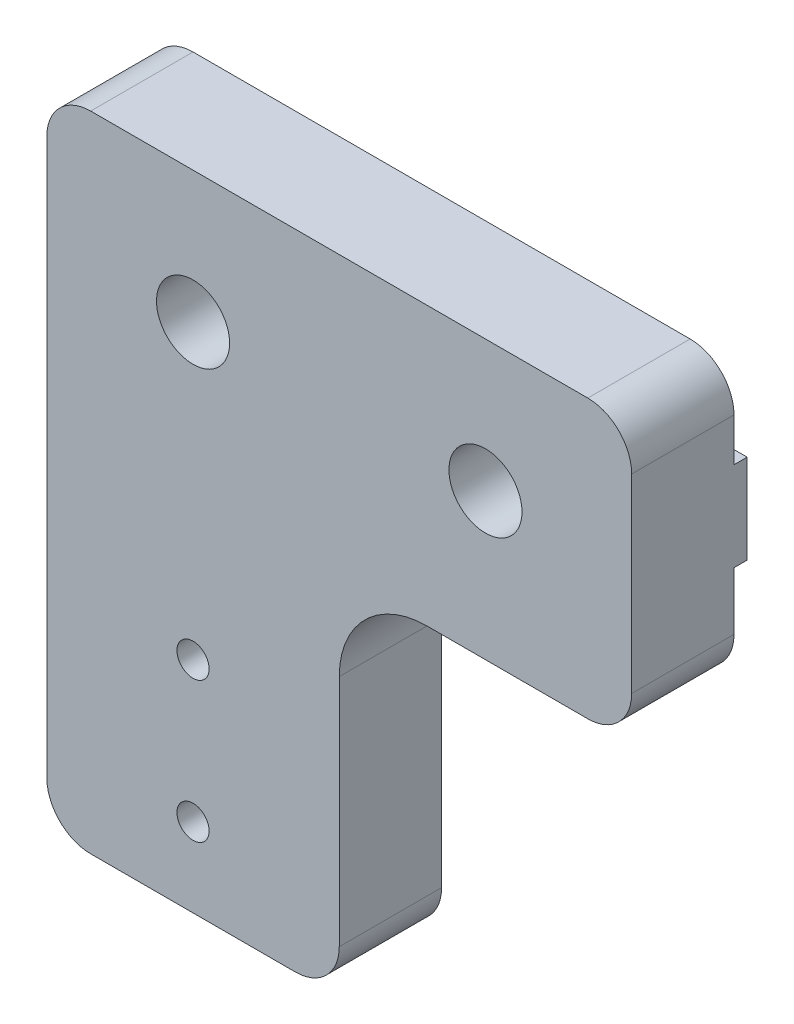
ISO-10303-21;
HEADER;
FILE_DESCRIPTION(('STEP AP214'),'2;1');
FILE_NAME('part.step','',(''),(''),'','','');
FILE_SCHEMA(('AUTOMOTIVE_DESIGN { 1 0 10303 214 1 1 1 1 }'));
ENDSEC;
DATA;
#1=APPLICATION_CONTEXT('core data for automotive mechanical design processes');
#2=APPLICATION_PROTOCOL_DEFINITION('international standard','automotive_design',2000,#1);
#3=PRODUCT_CONTEXT('',#1,'mechanical');
#4=PRODUCT('Part','Part','',(#3));
#5=PRODUCT_RELATED_PRODUCT_CATEGORY('part','',(#4));
#6=PRODUCT_DEFINITION_FORMATION('','',#4);
#7=PRODUCT_DEFINITION_CONTEXT('part definition',#1,'design');
#8=PRODUCT_DEFINITION('design','',#6,#7);
#9=PRODUCT_DEFINITION_SHAPE('','',#8);
#10=(LENGTH_UNIT() NAMED_UNIT(*) SI_UNIT(.MILLI.,.METRE.));
#11=(NAMED_UNIT(*) PLANE_ANGLE_UNIT() SI_UNIT($,.RADIAN.));
#12=(NAMED_UNIT(*) SI_UNIT($,.STERADIAN.) SOLID_ANGLE_UNIT());
#13=UNCERTAINTY_MEASURE_WITH_UNIT(LENGTH_MEASURE(1.E-05),#10,'distance_accuracy_value','');
#14=(GEOMETRIC_REPRESENTATION_CONTEXT(3) GLOBAL_UNCERTAINTY_ASSIGNED_CONTEXT((#13)) GLOBAL_UNIT_ASSIGNED_CONTEXT((#10,
#11,#12)) REPRESENTATION_CONTEXT('',''));
#15=CARTESIAN_POINT('',(0.,0.,0.));
#16=DIRECTION('',(0.,0.,1.));
#17=DIRECTION('',(1.,0.,0.));
#18=AXIS2_PLACEMENT_3D('',#15,#16,#17);
#19=CARTESIAN_POINT('',(26.,19.,0.));
#20=DIRECTION('',(0.,0.,-1.));
#21=DIRECTION('',(-1.,0.,0.));
#22=AXIS2_PLACEMENT_3D('',#19,#20,#21);
#23=PLANE('',#22);
#24=CARTESIAN_POINT('',(10.,5.4,0.));
#25=DIRECTION('',(0.,0.,1.));
#26=DIRECTION('',(1.,0.,0.));
#27=AXIS2_PLACEMENT_3D('',#24,#25,#26);
#28=CIRCLE('',#27,1.1);
#29=CARTESIAN_POINT('',(11.1,5.4,0.));
#30=VERTEX_POINT('',#29);
#31=EDGE_CURVE('E185',#30,#30,#28,.T.);
#32=ORIENTED_EDGE('',*,*,#31,.T.);
#33=EDGE_LOOP('',(#32));
#34=FACE_BOUND('',#33,.T.);
#35=CARTESIAN_POINT('',(10.,15.,0.));
#36=DIRECTION('',(0.,0.,1.));
#37=DIRECTION('',(1.,0.,0.));
#38=AXIS2_PLACEMENT_3D('',#35,#36,#37);
#39=CIRCLE('',#38,1.1);
#40=CARTESIAN_POINT('',(11.1,15.,0.));
#41=VERTEX_POINT('',#40);
#42=EDGE_CURVE('E186',#41,#41,#39,.T.);
#43=ORIENTED_EDGE('',*,*,#42,.T.);
#44=EDGE_LOOP('',(#43));
#45=FACE_BOUND('',#44,.T.);
#46=DIRECTION('',(0.,-1.,0.));
#47=VECTOR('',#46,1.);
#48=CARTESIAN_POINT('',(0.,41.,0.));
#49=LINE('',#48,#47);
#50=CARTESIAN_POINT('',(0.,31.95,0.));
#51=VERTEX_POINT('',#50);
#52=CARTESIAN_POINT('',(0.,3.00000000000002,0.));
#53=VERTEX_POINT('',#52);
#54=EDGE_CURVE('E54',#51,#53,#49,.T.);
#55=ORIENTED_EDGE('',*,*,#54,.F.);
#56=DIRECTION('',(1.,0.,0.));
#57=VECTOR('',#56,1.);
#58=CARTESIAN_POINT('',(-6.16603600378719,31.95,0.));
#59=LINE('',#58,#57);
#60=CARTESIAN_POINT('',(40.,31.95,0.));
#61=VERTEX_POINT('',#60);
#62=EDGE_CURVE('E49',#51,#61,#59,.T.);
#63=ORIENTED_EDGE('',*,*,#62,.T.);
#64=DIRECTION('',(0.,1.,0.));
#65=VECTOR('',#64,1.);
#66=CARTESIAN_POINT('',(40.,28.,0.));
#67=LINE('',#66,#65);
#68=CARTESIAN_POINT('',(40.,28.,0.));
#69=VERTEX_POINT('',#68);
#70=EDGE_CURVE('E169',#69,#61,#67,.T.);
#71=ORIENTED_EDGE('',*,*,#70,.F.);
#72=CARTESIAN_POINT('',(37.,28.,0.));
#73=DIRECTION('',(0.,0.,1.));
#74=DIRECTION('',(1.,0.,0.));
#75=AXIS2_PLACEMENT_3D('',#72,#73,#74);
#76=CIRCLE('',#75,3.);
#77=CARTESIAN_POINT('',(37.,25.,0.));
#78=VERTEX_POINT('',#77);
#79=EDGE_CURVE('E232',#78,#69,#76,.T.);
#80=ORIENTED_EDGE('',*,*,#79,.F.);
#81=DIRECTION('',(1.,0.,0.));
#82=VECTOR('',#81,1.);
#83=CARTESIAN_POINT('',(26.,25.,0.));
#84=LINE('',#83,#82);
#85=CARTESIAN_POINT('',(26.,25.,0.));
#86=VERTEX_POINT('',#85);
#87=EDGE_CURVE('E230',#86,#78,#84,.T.);
#88=ORIENTED_EDGE('',*,*,#87,.F.);
#89=CARTESIAN_POINT('',(26.,19.,0.));
#90=DIRECTION('',(0.,0.,-1.));
#91=DIRECTION('',(-1.,0.,0.));
#92=AXIS2_PLACEMENT_3D('',#89,#90,#91);
#93=CIRCLE('',#92,6.);
#94=CARTESIAN_POINT('',(20.,19.,0.));
#95=VERTEX_POINT('',#94);
#96=EDGE_CURVE('E200',#95,#86,#93,.T.);
#97=ORIENTED_EDGE('',*,*,#96,.F.);
#98=DIRECTION('',(0.,1.,0.));
#99=VECTOR('',#98,1.);
#100=CARTESIAN_POINT('',(20.,3.00000000000002,0.));
#101=LINE('',#100,#99);
#102=CARTESIAN_POINT('',(20.,3.00000000000002,0.));
#103=VERTEX_POINT('',#102);
#104=EDGE_CURVE('E205',#103,#95,#101,.T.);
#105=ORIENTED_EDGE('',*,*,#104,.F.);
#106=CARTESIAN_POINT('',(17.,3.,0.));
#107=DIRECTION('',(0.,0.,1.));
#108=DIRECTION('',(1.,0.,0.));
#109=AXIS2_PLACEMENT_3D('',#106,#107,#108);
#110=CIRCLE('',#109,3.);
#111=CARTESIAN_POINT('',(17.,0.,0.));
#112=VERTEX_POINT('',#111);
#113=EDGE_CURVE('E256',#112,#103,#110,.T.);
#114=ORIENTED_EDGE('',*,*,#113,.F.);
#115=DIRECTION('',(1.,0.,0.));
#116=VECTOR('',#115,1.);
#117=CARTESIAN_POINT('',(3.00000000000002,0.,0.));
#118=LINE('',#117,#116);
#119=CARTESIAN_POINT('',(3.00000000000002,0.,0.));
#120=VERTEX_POINT('',#119);
#121=EDGE_CURVE('E254',#120,#112,#118,.T.);
#122=ORIENTED_EDGE('',*,*,#121,.F.);
#123=CARTESIAN_POINT('',(3.,3.,0.));
#124=DIRECTION('',(0.,0.,1.));
#125=DIRECTION('',(1.,0.,0.));
#126=AXIS2_PLACEMENT_3D('',#123,#124,#125);
#127=CIRCLE('',#126,3.);
#128=EDGE_CURVE('E251',#53,#120,#127,.T.);
#129=ORIENTED_EDGE('',*,*,#128,.F.);
#130=EDGE_LOOP('',(#55,#63,#71,#80,#88,#97,#105,#114,#122,#129));
#131=FACE_BOUND('',#130,.T.);
#132=ADVANCED_FACE('F32',(#34,#45,#131),#23,.T.);
#133=CARTESIAN_POINT('',(26.,19.,7.));
#134=DIRECTION('',(0.,0.,-1.));
#135=DIRECTION('',(-1.,0.,0.));
#136=AXIS2_PLACEMENT_3D('',#133,#134,#135);
#137=PLANE('',#136);
#138=CARTESIAN_POINT('',(10.,5.4,7.));
#139=DIRECTION('',(0.,0.,1.));
#140=DIRECTION('',(1.,0.,0.));
#141=AXIS2_PLACEMENT_3D('',#138,#139,#140);
#142=CIRCLE('',#141,1.1);
#143=CARTESIAN_POINT('',(11.1,5.4,7.));
#144=VERTEX_POINT('',#143);
#145=EDGE_CURVE('E189',#144,#144,#142,.T.);
#146=ORIENTED_EDGE('',*,*,#145,.F.);
#147=EDGE_LOOP('',(#146));
#148=FACE_BOUND('',#147,.T.);
#149=CARTESIAN_POINT('',(10.,35.,7.));
#150=DIRECTION('',(0.,0.,1.));
#151=DIRECTION('',(1.,0.,0.));
#152=AXIS2_PLACEMENT_3D('',#149,#150,#151);
#153=CIRCLE('',#152,2.5);
#154=CARTESIAN_POINT('',(12.5,35.,7.));
#155=VERTEX_POINT('',#154);
#156=EDGE_CURVE('E197',#155,#155,#153,.T.);
#157=ORIENTED_EDGE('',*,*,#156,.F.);
#158=EDGE_LOOP('',(#157));
#159=FACE_BOUND('',#158,.T.);
#160=CARTESIAN_POINT('',(26.,19.,7.));
#161=DIRECTION('',(0.,0.,-1.));
#162=DIRECTION('',(-1.,0.,0.));
#163=AXIS2_PLACEMENT_3D('',#160,#161,#162);
#164=CIRCLE('',#163,6.);
#165=CARTESIAN_POINT('',(20.,19.,7.));
#166=VERTEX_POINT('',#165);
#167=CARTESIAN_POINT('',(26.,25.,7.));
#168=VERTEX_POINT('',#167);
#169=EDGE_CURVE('E201',#166,#168,#164,.T.);
#170=ORIENTED_EDGE('',*,*,#169,.T.);
#171=DIRECTION('',(1.,0.,0.));
#172=VECTOR('',#171,1.);
#173=CARTESIAN_POINT('',(26.,25.,7.));
#174=LINE('',#173,#172);
#175=CARTESIAN_POINT('',(37.,25.,7.));
#176=VERTEX_POINT('',#175);
#177=EDGE_CURVE('E204',#168,#176,#174,.T.);
#178=ORIENTED_EDGE('',*,*,#177,.T.);
#179=CARTESIAN_POINT('',(37.,28.,7.));
#180=DIRECTION('',(0.,0.,1.));
#181=DIRECTION('',(1.,0.,0.));
#182=AXIS2_PLACEMENT_3D('',#179,#180,#181);
#183=CIRCLE('',#182,3.);
#184=CARTESIAN_POINT('',(40.,28.,7.));
#185=VERTEX_POINT('',#184);
#186=EDGE_CURVE('E207',#176,#185,#183,.T.);
#187=ORIENTED_EDGE('',*,*,#186,.T.);
#188=DIRECTION('',(0.,1.,0.));
#189=VECTOR('',#188,1.);
#190=CARTESIAN_POINT('',(40.,28.,7.));
#191=LINE('',#190,#189);
#192=CARTESIAN_POINT('',(40.,41.,7.));
#193=VERTEX_POINT('',#192);
#194=EDGE_CURVE('E209',#185,#193,#191,.T.);
#195=ORIENTED_EDGE('',*,*,#194,.T.);
#196=CARTESIAN_POINT('',(37.,41.,7.));
#197=DIRECTION('',(0.,0.,1.));
#198=DIRECTION('',(1.,0.,0.));
#199=AXIS2_PLACEMENT_3D('',#196,#197,#198);
#200=CIRCLE('',#199,3.);
#201=CARTESIAN_POINT('',(37.,44.,7.));
#202=VERTEX_POINT('',#201);
#203=EDGE_CURVE('E211',#193,#202,#200,.T.);
#204=ORIENTED_EDGE('',*,*,#203,.T.);
#205=DIRECTION('',(-1.,0.,0.));
#206=VECTOR('',#205,1.);
#207=CARTESIAN_POINT('',(37.,44.,7.));
#208=LINE('',#207,#206);
#209=CARTESIAN_POINT('',(3.00000000000002,44.,7.));
#210=VERTEX_POINT('',#209);
#211=EDGE_CURVE('E213',#202,#210,#208,.T.);
#212=ORIENTED_EDGE('',*,*,#211,.T.);
#213=CARTESIAN_POINT('',(3.,41.,7.));
#214=DIRECTION('',(0.,0.,1.));
#215=DIRECTION('',(1.,0.,0.));
#216=AXIS2_PLACEMENT_3D('',#213,#214,#215);
#217=CIRCLE('',#216,3.);
#218=CARTESIAN_POINT('',(0.,41.,7.));
#219=VERTEX_POINT('',#218);
#220=EDGE_CURVE('E215',#210,#219,#217,.T.);
#221=ORIENTED_EDGE('',*,*,#220,.T.);
#222=DIRECTION('',(0.,-1.,0.));
#223=VECTOR('',#222,1.);
#224=CARTESIAN_POINT('',(0.,41.,7.));
#225=LINE('',#224,#223);
#226=CARTESIAN_POINT('',(0.,3.00000000000002,7.));
#227=VERTEX_POINT('',#226);
#228=EDGE_CURVE('E217',#219,#227,#225,.T.);
#229=ORIENTED_EDGE('',*,*,#228,.T.);
#230=CARTESIAN_POINT('',(3.,3.,7.));
#231=DIRECTION('',(0.,0.,1.));
#232=DIRECTION('',(1.,0.,0.));
#233=AXIS2_PLACEMENT_3D('',#230,#231,#232);
#234=CIRCLE('',#233,3.);
#235=CARTESIAN_POINT('',(3.00000000000002,0.,7.));
#236=VERTEX_POINT('',#235);
#237=EDGE_CURVE('E219',#227,#236,#234,.T.);
#238=ORIENTED_EDGE('',*,*,#237,.T.);
#239=DIRECTION('',(1.,0.,0.));
#240=VECTOR('',#239,1.);
#241=CARTESIAN_POINT('',(3.00000000000002,0.,7.));
#242=LINE('',#241,#240);
#243=CARTESIAN_POINT('',(17.,0.,7.));
#244=VERTEX_POINT('',#243);
#245=EDGE_CURVE('E221',#236,#244,#242,.T.);
#246=ORIENTED_EDGE('',*,*,#245,.T.);
#247=CARTESIAN_POINT('',(17.,3.,7.));
#248=DIRECTION('',(0.,0.,1.));
#249=DIRECTION('',(1.,0.,0.));
#250=AXIS2_PLACEMENT_3D('',#247,#248,#249);
#251=CIRCLE('',#250,3.);
#252=CARTESIAN_POINT('',(20.,3.00000000000002,7.));
#253=VERTEX_POINT('',#252);
#254=EDGE_CURVE('E223',#244,#253,#251,.T.);
#255=ORIENTED_EDGE('',*,*,#254,.T.);
#256=DIRECTION('',(0.,1.,0.));
#257=VECTOR('',#256,1.);
#258=CARTESIAN_POINT('',(20.,3.00000000000002,7.));
#259=LINE('',#258,#257);
#260=EDGE_CURVE('E225',#253,#166,#259,.T.);
#261=ORIENTED_EDGE('',*,*,#260,.T.);
#262=EDGE_LOOP('',(#170,#178,#187,#195,#204,#212,#221,#229,#238,#246,#255,#261));
#263=FACE_BOUND('',#262,.T.);
#264=CARTESIAN_POINT('',(30.,35.,7.));
#265=DIRECTION('',(0.,0.,1.));
#266=DIRECTION('',(1.,0.,0.));
#267=AXIS2_PLACEMENT_3D('',#264,#265,#266);
#268=CIRCLE('',#267,2.5);
#269=CARTESIAN_POINT('',(32.5,35.,7.));
#270=VERTEX_POINT('',#269);
#271=EDGE_CURVE('E192',#270,#270,#268,.T.);
#272=ORIENTED_EDGE('',*,*,#271,.F.);
#273=EDGE_LOOP('',(#272));
#274=FACE_BOUND('',#273,.T.);
#275=CARTESIAN_POINT('',(10.,15.,7.));
#276=DIRECTION('',(0.,0.,1.));
#277=DIRECTION('',(1.,0.,0.));
#278=AXIS2_PLACEMENT_3D('',#275,#276,#277);
#279=CIRCLE('',#278,1.1);
#280=CARTESIAN_POINT('',(11.1,15.,7.));
#281=VERTEX_POINT('',#280);
#282=EDGE_CURVE('E182',#281,#281,#279,.T.);
#283=ORIENTED_EDGE('',*,*,#282,.F.);
#284=EDGE_LOOP('',(#283));
#285=FACE_BOUND('',#284,.T.);
#286=ADVANCED_FACE('F364',(#148,#159,#263,#274,#285),#137,.F.);
#287=DIRECTION('',(1.,0.,0.));
#288=VECTOR('',#287,1.);
#289=CARTESIAN_POINT('',(-6.16603600378719,38.05,0.));
#290=LINE('',#289,#288);
#291=CARTESIAN_POINT('',(0.,38.05,0.));
#292=VERTEX_POINT('',#291);
#293=CARTESIAN_POINT('',(40.,38.05,0.));
#294=VERTEX_POINT('',#293);
#295=EDGE_CURVE('E333',#292,#294,#290,.T.);
#296=ORIENTED_EDGE('',*,*,#295,.F.);
#297=CARTESIAN_POINT('',(0.,41.,0.));
#298=VERTEX_POINT('',#297);
#299=EDGE_CURVE('E246',#298,#292,#49,.T.);
#300=ORIENTED_EDGE('',*,*,#299,.F.);
#301=CARTESIAN_POINT('',(3.,41.,0.));
#302=DIRECTION('',(0.,0.,1.));
#303=DIRECTION('',(1.,0.,0.));
#304=AXIS2_PLACEMENT_3D('',#301,#302,#303);
#305=CIRCLE('',#304,3.);
#306=CARTESIAN_POINT('',(3.00000000000002,44.,0.));
#307=VERTEX_POINT('',#306);
#308=EDGE_CURVE('E247',#307,#298,#305,.T.);
#309=ORIENTED_EDGE('',*,*,#308,.F.);
#310=DIRECTION('',(-1.,0.,0.));
#311=VECTOR('',#310,1.);
#312=CARTESIAN_POINT('',(37.,44.,0.));
#313=LINE('',#312,#311);
#314=CARTESIAN_POINT('',(37.,44.,0.));
#315=VERTEX_POINT('',#314);
#316=EDGE_CURVE('E390',#315,#307,#313,.T.);
#317=ORIENTED_EDGE('',*,*,#316,.F.);
#318=CARTESIAN_POINT('',(37.,41.,0.));
#319=DIRECTION('',(0.,0.,1.));
#320=DIRECTION('',(1.,0.,0.));
#321=AXIS2_PLACEMENT_3D('',#318,#319,#320);
#322=CIRCLE('',#321,3.);
#323=CARTESIAN_POINT('',(40.,41.,0.));
#324=VERTEX_POINT('',#323);
#325=EDGE_CURVE('E237',#324,#315,#322,.T.);
#326=ORIENTED_EDGE('',*,*,#325,.F.);
#327=EDGE_CURVE('E234',#294,#324,#67,.T.);
#328=ORIENTED_EDGE('',*,*,#327,.F.);
#329=EDGE_LOOP('',(#296,#300,#309,#317,#326,#328));
#330=FACE_BOUND('',#329,.T.);
#331=ADVANCED_FACE('F367',(#330),#23,.T.);
#332=CARTESIAN_POINT('',(26.,19.,7.));
#333=DIRECTION('',(0.,0.,-1.));
#334=DIRECTION('',(-1.,0.,0.));
#335=AXIS2_PLACEMENT_3D('',#332,#333,#334);
#336=CYLINDRICAL_SURFACE('',#335,6.);
#337=ORIENTED_EDGE('',*,*,#96,.T.);
#338=DIRECTION('',(0.,0.,-1.));
#339=VECTOR('',#338,1.);
#340=CARTESIAN_POINT('',(26.,25.,7.));
#341=LINE('',#340,#339);
#342=EDGE_CURVE('E11',#168,#86,#341,.T.);
#343=ORIENTED_EDGE('',*,*,#342,.F.);
#344=ORIENTED_EDGE('',*,*,#169,.F.);
#345=DIRECTION('',(0.,0.,-1.));
#346=VECTOR('',#345,1.);
#347=CARTESIAN_POINT('',(20.,19.,7.));
#348=LINE('',#347,#346);
#349=EDGE_CURVE('E227',#166,#95,#348,.T.);
#350=ORIENTED_EDGE('',*,*,#349,.T.);
#351=EDGE_LOOP('',(#337,#343,#344,#350));
#352=FACE_BOUND('',#351,.T.);
#353=ADVANCED_FACE('F34',(#352),#336,.F.);
#354=CARTESIAN_POINT('',(26.,25.,7.));
#355=DIRECTION('',(0.,1.,0.));
#356=DIRECTION('',(0.,0.,1.));
#357=AXIS2_PLACEMENT_3D('',#354,#355,#356);
#358=PLANE('',#357);
#359=ORIENTED_EDGE('',*,*,#87,.T.);
#360=DIRECTION('',(0.,0.,-1.));
#361=VECTOR('',#360,1.);
#362=CARTESIAN_POINT('',(37.,25.,7.));
#363=LINE('',#362,#361);
#364=EDGE_CURVE('E41',#176,#78,#363,.T.);
#365=ORIENTED_EDGE('',*,*,#364,.F.);
#366=ORIENTED_EDGE('',*,*,#177,.F.);
#367=ORIENTED_EDGE('',*,*,#342,.T.);
#368=EDGE_LOOP('',(#359,#365,#366,#367));
#369=FACE_BOUND('',#368,.T.);
#370=ADVANCED_FACE('F298',(#369),#358,.F.);
#371=CARTESIAN_POINT('',(37.,28.,7.));
#372=DIRECTION('',(0.,0.,-1.));
#373=DIRECTION('',(-1.,0.,0.));
#374=AXIS2_PLACEMENT_3D('',#371,#372,#373);
#375=CYLINDRICAL_SURFACE('',#374,3.);
#376=ORIENTED_EDGE('',*,*,#79,.T.);
#377=DIRECTION('',(0.,0.,-1.));
#378=VECTOR('',#377,1.);
#379=CARTESIAN_POINT('',(40.,28.,7.));
#380=LINE('',#379,#378);
#381=EDGE_CURVE('E285',#185,#69,#380,.T.);
#382=ORIENTED_EDGE('',*,*,#381,.F.);
#383=ORIENTED_EDGE('',*,*,#186,.F.);
#384=ORIENTED_EDGE('',*,*,#364,.T.);
#385=EDGE_LOOP('',(#376,#382,#383,#384));
#386=FACE_BOUND('',#385,.T.);
#387=ADVANCED_FACE('F292',(#386),#375,.T.);
#388=CARTESIAN_POINT('',(40.,28.,7.));
#389=DIRECTION('',(-1.,0.,0.));
#390=DIRECTION('',(0.,0.,1.));
#391=AXIS2_PLACEMENT_3D('',#388,#389,#390);
#392=PLANE('',#391);
#393=ORIENTED_EDGE('',*,*,#70,.T.);
#394=DIRECTION('',(0.,0.,-1.));
#395=VECTOR('',#394,1.);
#396=CARTESIAN_POINT('',(40.,31.95,0.));
#397=LINE('',#396,#395);
#398=CARTESIAN_POINT('',(40.,31.95,-0.900000000000001));
#399=VERTEX_POINT('',#398);
#400=EDGE_CURVE('E152',#61,#399,#397,.T.);
#401=ORIENTED_EDGE('',*,*,#400,.T.);
#402=DIRECTION('',(0.,-1.,0.));
#403=VECTOR('',#402,1.);
#404=CARTESIAN_POINT('',(40.,38.05,-0.900000000000001));
#405=LINE('',#404,#403);
#406=CARTESIAN_POINT('',(40.,38.05,-0.900000000000001));
#407=VERTEX_POINT('',#406);
#408=EDGE_CURVE('E159',#407,#399,#405,.T.);
#409=ORIENTED_EDGE('',*,*,#408,.F.);
#410=DIRECTION('',(0.,0.,-1.));
#411=VECTOR('',#410,1.);
#412=CARTESIAN_POINT('',(40.,38.05,0.));
#413=LINE('',#412,#411);
#414=EDGE_CURVE('E165',#294,#407,#413,.T.);
#415=ORIENTED_EDGE('',*,*,#414,.F.);
#416=ORIENTED_EDGE('',*,*,#327,.T.);
#417=DIRECTION('',(0.,0.,-1.));
#418=VECTOR('',#417,1.);
#419=CARTESIAN_POINT('',(40.,41.,7.));
#420=LINE('',#419,#418);
#421=EDGE_CURVE('E282',#193,#324,#420,.T.);
#422=ORIENTED_EDGE('',*,*,#421,.F.);
#423=ORIENTED_EDGE('',*,*,#194,.F.);
#424=ORIENTED_EDGE('',*,*,#381,.T.);
#425=EDGE_LOOP('',(#393,#401,#409,#415,#416,#422,#423,#424));
#426=FACE_BOUND('',#425,.T.);
#427=ADVANCED_FACE('F167',(#426),#392,.F.);
#428=CARTESIAN_POINT('',(37.,41.,7.));
#429=DIRECTION('',(0.,0.,-1.));
#430=DIRECTION('',(-1.,0.,0.));
#431=AXIS2_PLACEMENT_3D('',#428,#429,#430);
#432=CYLINDRICAL_SURFACE('',#431,3.);
#433=ORIENTED_EDGE('',*,*,#325,.T.);
#434=DIRECTION('',(0.,0.,-1.));
#435=VECTOR('',#434,1.);
#436=CARTESIAN_POINT('',(37.,44.,7.));
#437=LINE('',#436,#435);
#438=EDGE_CURVE('E279',#202,#315,#437,.T.);
#439=ORIENTED_EDGE('',*,*,#438,.F.);
#440=ORIENTED_EDGE('',*,*,#203,.F.);
#441=ORIENTED_EDGE('',*,*,#421,.T.);
#442=EDGE_LOOP('',(#433,#439,#440,#441));
#443=FACE_BOUND('',#442,.T.);
#444=ADVANCED_FACE('F387',(#443),#432,.T.);
#445=CARTESIAN_POINT('',(37.,44.,7.));
#446=DIRECTION('',(0.,-1.,0.));
#447=DIRECTION('',(1.,0.,0.));
#448=AXIS2_PLACEMENT_3D('',#445,#446,#447);
#449=PLANE('',#448);
#450=ORIENTED_EDGE('',*,*,#316,.T.);
#451=DIRECTION('',(0.,0.,-1.));
#452=VECTOR('',#451,1.);
#453=CARTESIAN_POINT('',(3.00000000000002,44.,7.));
#454=LINE('',#453,#452);
#455=EDGE_CURVE('E276',#210,#307,#454,.T.);
#456=ORIENTED_EDGE('',*,*,#455,.F.);
#457=ORIENTED_EDGE('',*,*,#211,.F.);
#458=ORIENTED_EDGE('',*,*,#438,.T.);
#459=EDGE_LOOP('',(#450,#456,#457,#458));
#460=FACE_BOUND('',#459,.T.);
#461=ADVANCED_FACE('F397',(#460),#449,.F.);
#462=CARTESIAN_POINT('',(3.,41.,7.));
#463=DIRECTION('',(0.,0.,-1.));
#464=DIRECTION('',(-1.,0.,0.));
#465=AXIS2_PLACEMENT_3D('',#462,#463,#464);
#466=CYLINDRICAL_SURFACE('',#465,3.);
#467=ORIENTED_EDGE('',*,*,#308,.T.);
#468=DIRECTION('',(0.,0.,-1.));
#469=VECTOR('',#468,1.);
#470=CARTESIAN_POINT('',(0.,41.,7.));
#471=LINE('',#470,#469);
#472=EDGE_CURVE('E273',#219,#298,#471,.T.);
#473=ORIENTED_EDGE('',*,*,#472,.F.);
#474=ORIENTED_EDGE('',*,*,#220,.F.);
#475=ORIENTED_EDGE('',*,*,#455,.T.);
#476=EDGE_LOOP('',(#467,#473,#474,#475));
#477=FACE_BOUND('',#476,.T.);
#478=ADVANCED_FACE('F394',(#477),#466,.T.);
#479=CARTESIAN_POINT('',(0.,41.,7.));
#480=DIRECTION('',(1.,0.,0.));
#481=DIRECTION('',(0.,0.,-1.));
#482=AXIS2_PLACEMENT_3D('',#479,#480,#481);
#483=PLANE('',#482);
#484=ORIENTED_EDGE('',*,*,#299,.T.);
#485=DIRECTION('',(0.,0.,1.));
#486=VECTOR('',#485,1.);
#487=CARTESIAN_POINT('',(0.,38.05,0.));
#488=LINE('',#487,#486);
#489=CARTESIAN_POINT('',(0.,38.05,-0.900000000000001));
#490=VERTEX_POINT('',#489);
#491=EDGE_CURVE('E325',#490,#292,#488,.T.);
#492=ORIENTED_EDGE('',*,*,#491,.F.);
#493=DIRECTION('',(0.,1.,0.));
#494=VECTOR('',#493,1.);
#495=CARTESIAN_POINT('',(0.,38.05,-0.900000000000001));
#496=LINE('',#495,#494);
#497=CARTESIAN_POINT('',(0.,31.95,-0.900000000000001));
#498=VERTEX_POINT('',#497);
#499=EDGE_CURVE('E324',#498,#490,#496,.T.);
#500=ORIENTED_EDGE('',*,*,#499,.F.);
#501=DIRECTION('',(0.,0.,1.));
#502=VECTOR('',#501,1.);
#503=CARTESIAN_POINT('',(0.,31.95,0.));
#504=LINE('',#503,#502);
#505=EDGE_CURVE('E153',#498,#51,#504,.T.);
#506=ORIENTED_EDGE('',*,*,#505,.T.);
#507=ORIENTED_EDGE('',*,*,#54,.T.);
#508=DIRECTION('',(0.,0.,-1.));
#509=VECTOR('',#508,1.);
#510=CARTESIAN_POINT('',(0.,3.00000000000002,7.));
#511=LINE('',#510,#509);
#512=EDGE_CURVE('E270',#227,#53,#511,.T.);
#513=ORIENTED_EDGE('',*,*,#512,.F.);
#514=ORIENTED_EDGE('',*,*,#228,.F.);
#515=ORIENTED_EDGE('',*,*,#472,.T.);
#516=EDGE_LOOP('',(#484,#492,#500,#506,#507,#513,#514,#515));
#517=FACE_BOUND('',#516,.T.);
#518=ADVANCED_FACE('F323',(#517),#483,.F.);
#519=CARTESIAN_POINT('',(3.,3.,7.));
#520=DIRECTION('',(0.,0.,-1.));
#521=DIRECTION('',(-1.,0.,0.));
#522=AXIS2_PLACEMENT_3D('',#519,#520,#521);
#523=CYLINDRICAL_SURFACE('',#522,3.);
#524=ORIENTED_EDGE('',*,*,#128,.T.);
#525=DIRECTION('',(0.,0.,-1.));
#526=VECTOR('',#525,1.);
#527=CARTESIAN_POINT('',(3.00000000000002,0.,7.));
#528=LINE('',#527,#526);
#529=EDGE_CURVE('E267',#236,#120,#528,.T.);
#530=ORIENTED_EDGE('',*,*,#529,.F.);
#531=ORIENTED_EDGE('',*,*,#237,.F.);
#532=ORIENTED_EDGE('',*,*,#512,.T.);
#533=EDGE_LOOP('',(#524,#530,#531,#532));
#534=FACE_BOUND('',#533,.T.);
#535=ADVANCED_FACE('F318',(#534),#523,.T.);
#536=CARTESIAN_POINT('',(3.00000000000002,0.,7.));
#537=DIRECTION('',(0.,1.,0.));
#538=DIRECTION('',(0.,0.,1.));
#539=AXIS2_PLACEMENT_3D('',#536,#537,#538);
#540=PLANE('',#539);
#541=ORIENTED_EDGE('',*,*,#121,.T.);
#542=DIRECTION('',(0.,0.,-1.));
#543=VECTOR('',#542,1.);
#544=CARTESIAN_POINT('',(17.,0.,7.));
#545=LINE('',#544,#543);
#546=EDGE_CURVE('E264',#244,#112,#545,.T.);
#547=ORIENTED_EDGE('',*,*,#546,.F.);
#548=ORIENTED_EDGE('',*,*,#245,.F.);
#549=ORIENTED_EDGE('',*,*,#529,.T.);
#550=EDGE_LOOP('',(#541,#547,#548,#549));
#551=FACE_BOUND('',#550,.T.);
#552=ADVANCED_FACE('F314',(#551),#540,.F.);
#553=CARTESIAN_POINT('',(17.,3.,7.));
#554=DIRECTION('',(0.,0.,-1.));
#555=DIRECTION('',(-1.,0.,0.));
#556=AXIS2_PLACEMENT_3D('',#553,#554,#555);
#557=CYLINDRICAL_SURFACE('',#556,3.);
#558=ORIENTED_EDGE('',*,*,#113,.T.);
#559=DIRECTION('',(0.,0.,-1.));
#560=VECTOR('',#559,1.);
#561=CARTESIAN_POINT('',(20.,3.00000000000002,7.));
#562=LINE('',#561,#560);
#563=EDGE_CURVE('E261',#253,#103,#562,.T.);
#564=ORIENTED_EDGE('',*,*,#563,.F.);
#565=ORIENTED_EDGE('',*,*,#254,.F.);
#566=ORIENTED_EDGE('',*,*,#546,.T.);
#567=EDGE_LOOP('',(#558,#564,#565,#566));
#568=FACE_BOUND('',#567,.T.);
#569=ADVANCED_FACE('F309',(#568),#557,.T.);
#570=CARTESIAN_POINT('',(20.,3.00000000000002,7.));
#571=DIRECTION('',(-1.,0.,0.));
#572=DIRECTION('',(0.,0.,1.));
#573=AXIS2_PLACEMENT_3D('',#570,#571,#572);
#574=PLANE('',#573);
#575=ORIENTED_EDGE('',*,*,#104,.T.);
#576=ORIENTED_EDGE('',*,*,#349,.F.);
#577=ORIENTED_EDGE('',*,*,#260,.F.);
#578=ORIENTED_EDGE('',*,*,#563,.T.);
#579=EDGE_LOOP('',(#575,#576,#577,#578));
#580=FACE_BOUND('',#579,.T.);
#581=ADVANCED_FACE('F304',(#580),#574,.F.);
#582=CARTESIAN_POINT('',(10.,35.,7.));
#583=DIRECTION('',(0.,0.,-1.));
#584=DIRECTION('',(-1.,0.,0.));
#585=AXIS2_PLACEMENT_3D('',#582,#583,#584);
#586=CYLINDRICAL_SURFACE('',#585,2.5);
#587=ORIENTED_EDGE('',*,*,#156,.T.);
#588=EDGE_LOOP('',(#587));
#589=FACE_BOUND('',#588,.T.);
#590=CARTESIAN_POINT('',(10.,35.,-0.900000000000001));
#591=DIRECTION('',(0.,0.,1.));
#592=DIRECTION('',(1.,0.,0.));
#593=AXIS2_PLACEMENT_3D('',#590,#591,#592);
#594=CIRCLE('',#593,2.5);
#595=CARTESIAN_POINT('',(12.5,35.,-0.900000000000001));
#596=VERTEX_POINT('',#595);
#597=EDGE_CURVE('E170',#596,#596,#594,.F.);
#598=ORIENTED_EDGE('',*,*,#597,.T.);
#599=EDGE_LOOP('',(#598));
#600=FACE_BOUND('',#599,.T.);
#601=ADVANCED_FACE('F350',(#589,#600),#586,.F.);
#602=CARTESIAN_POINT('',(30.,35.,7.));
#603=DIRECTION('',(0.,0.,-1.));
#604=DIRECTION('',(-1.,0.,0.));
#605=AXIS2_PLACEMENT_3D('',#602,#603,#604);
#606=CYLINDRICAL_SURFACE('',#605,2.5);
#607=ORIENTED_EDGE('',*,*,#271,.T.);
#608=EDGE_LOOP('',(#607));
#609=FACE_BOUND('',#608,.T.);
#610=CARTESIAN_POINT('',(30.,35.,-0.900000000000001));
#611=DIRECTION('',(0.,0.,1.));
#612=DIRECTION('',(1.,0.,0.));
#613=AXIS2_PLACEMENT_3D('',#610,#611,#612);
#614=CIRCLE('',#613,2.5);
#615=CARTESIAN_POINT('',(32.5,35.,-0.900000000000001));
#616=VERTEX_POINT('',#615);
#617=EDGE_CURVE('E172',#616,#616,#614,.F.);
#618=ORIENTED_EDGE('',*,*,#617,.T.);
#619=EDGE_LOOP('',(#618));
#620=FACE_BOUND('',#619,.T.);
#621=ADVANCED_FACE('F342',(#609,#620),#606,.F.);
#622=CARTESIAN_POINT('',(10.,5.4,7.));
#623=DIRECTION('',(0.,0.,-1.));
#624=DIRECTION('',(-1.,0.,0.));
#625=AXIS2_PLACEMENT_3D('',#622,#623,#624);
#626=CYLINDRICAL_SURFACE('',#625,1.1);
#627=ORIENTED_EDGE('',*,*,#145,.T.);
#628=EDGE_LOOP('',(#627));
#629=FACE_BOUND('',#628,.T.);
#630=ORIENTED_EDGE('',*,*,#31,.F.);
#631=EDGE_LOOP('',(#630));
#632=FACE_BOUND('',#631,.T.);
#633=ADVANCED_FACE('F358',(#629,#632),#626,.F.);
#634=CARTESIAN_POINT('',(10.,15.,7.));
#635=DIRECTION('',(0.,0.,-1.));
#636=DIRECTION('',(-1.,0.,0.));
#637=AXIS2_PLACEMENT_3D('',#634,#635,#636);
#638=CYLINDRICAL_SURFACE('',#637,1.1);
#639=ORIENTED_EDGE('',*,*,#282,.T.);
#640=EDGE_LOOP('',(#639));
#641=FACE_BOUND('',#640,.T.);
#642=ORIENTED_EDGE('',*,*,#42,.F.);
#643=EDGE_LOOP('',(#642));
#644=FACE_BOUND('',#643,.T.);
#645=ADVANCED_FACE('F404',(#641,#644),#638,.F.);
#646=CARTESIAN_POINT('',(-6.16603600378719,31.95,0.));
#647=DIRECTION('',(0.,-1.,0.));
#648=DIRECTION('',(0.,0.,-1.));
#649=AXIS2_PLACEMENT_3D('',#646,#647,#648);
#650=PLANE('',#649);
#651=ORIENTED_EDGE('',*,*,#505,.F.);
#652=DIRECTION('',(1.,0.,0.));
#653=VECTOR('',#652,1.);
#654=CARTESIAN_POINT('',(-6.16603600378719,31.95,-0.900000000000001));
#655=LINE('',#654,#653);
#656=EDGE_CURVE('E148',#498,#399,#655,.T.);
#657=ORIENTED_EDGE('',*,*,#656,.T.);
#658=ORIENTED_EDGE('',*,*,#400,.F.);
#659=ORIENTED_EDGE('',*,*,#62,.F.);
#660=EDGE_LOOP('',(#651,#657,#658,#659));
#661=FACE_BOUND('',#660,.T.);
#662=ADVANCED_FACE('F150',(#661),#650,.T.);
#663=CARTESIAN_POINT('',(-6.16603600378719,38.05,-0.900000000000001));
#664=DIRECTION('',(0.,0.,1.));
#665=DIRECTION('',(1.,0.,0.));
#666=AXIS2_PLACEMENT_3D('',#663,#664,#665);
#667=PLANE('',#666);
#668=ORIENTED_EDGE('',*,*,#617,.F.);
#669=EDGE_LOOP('',(#668));
#670=FACE_BOUND('',#669,.T.);
#671=ORIENTED_EDGE('',*,*,#597,.F.);
#672=EDGE_LOOP('',(#671));
#673=FACE_BOUND('',#672,.T.);
#674=ORIENTED_EDGE('',*,*,#656,.F.);
#675=ORIENTED_EDGE('',*,*,#499,.T.);
#676=DIRECTION('',(1.,0.,0.));
#677=VECTOR('',#676,1.);
#678=CARTESIAN_POINT('',(-6.16603600378719,38.05,-0.900000000000001));
#679=LINE('',#678,#677);
#680=EDGE_CURVE('E156',#490,#407,#679,.T.);
#681=ORIENTED_EDGE('',*,*,#680,.T.);
#682=ORIENTED_EDGE('',*,*,#408,.T.);
#683=EDGE_LOOP('',(#674,#675,#681,#682));
#684=FACE_BOUND('',#683,.T.);
#685=ADVANCED_FACE('F160',(#670,#673,#684),#667,.F.);
#686=CARTESIAN_POINT('',(-6.16603600378719,38.05,0.));
#687=DIRECTION('',(0.,-1.,0.));
#688=DIRECTION('',(0.,0.,-1.));
#689=AXIS2_PLACEMENT_3D('',#686,#687,#688);
#690=PLANE('',#689);
#691=ORIENTED_EDGE('',*,*,#680,.F.);
#692=ORIENTED_EDGE('',*,*,#491,.T.);
#693=ORIENTED_EDGE('',*,*,#295,.T.);
#694=ORIENTED_EDGE('',*,*,#414,.T.);
#695=EDGE_LOOP('',(#691,#692,#693,#694));
#696=FACE_BOUND('',#695,.T.);
#697=ADVANCED_FACE('F346',(#696),#690,.F.);
#698=CLOSED_SHELL('',(#132,#286,#331,#353,#370,#387,#427,#444,#461,#478,#518,#535,#552,#569,
#581,#601,#621,#633,#645,#662,#685,#697));
#699=MANIFOLD_SOLID_BREP('B2',#698);
#700=ADVANCED_BREP_SHAPE_REPRESENTATION('',(#18,#699),#14);
#701=SHAPE_DEFINITION_REPRESENTATION(#9,#700);
ENDSEC;
END-ISO-10303-21;
